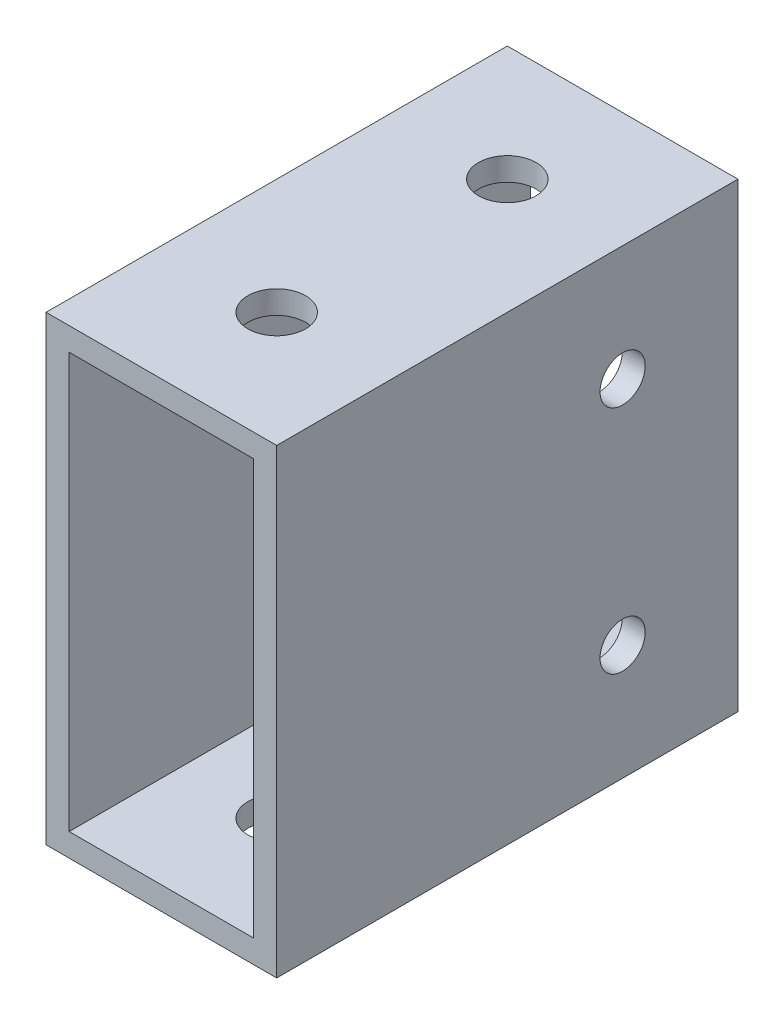
ISO-10303-21;
HEADER;
FILE_DESCRIPTION(('STEP AP214'),'2;1');
FILE_NAME('part.step','',(''),(''),'','','');
FILE_SCHEMA(('AUTOMOTIVE_DESIGN { 1 0 10303 214 1 1 1 1 }'));
ENDSEC;
DATA;
#1=APPLICATION_CONTEXT('core data for automotive mechanical design processes');
#2=APPLICATION_PROTOCOL_DEFINITION('international standard','automotive_design',2000,#1);
#3=PRODUCT_CONTEXT('',#1,'mechanical');
#4=PRODUCT('Part','Part','',(#3));
#5=PRODUCT_RELATED_PRODUCT_CATEGORY('part','',(#4));
#6=PRODUCT_DEFINITION_FORMATION('','',#4);
#7=PRODUCT_DEFINITION_CONTEXT('part definition',#1,'design');
#8=PRODUCT_DEFINITION('design','',#6,#7);
#9=PRODUCT_DEFINITION_SHAPE('','',#8);
#10=(LENGTH_UNIT() NAMED_UNIT(*) SI_UNIT(.MILLI.,.METRE.));
#11=(NAMED_UNIT(*) PLANE_ANGLE_UNIT() SI_UNIT($,.RADIAN.));
#12=(NAMED_UNIT(*) SI_UNIT($,.STERADIAN.) SOLID_ANGLE_UNIT());
#13=UNCERTAINTY_MEASURE_WITH_UNIT(LENGTH_MEASURE(1.E-05),#10,'distance_accuracy_value','');
#14=(GEOMETRIC_REPRESENTATION_CONTEXT(3) GLOBAL_UNCERTAINTY_ASSIGNED_CONTEXT((#13)) GLOBAL_UNIT_ASSIGNED_CONTEXT((#10,
#11,#12)) REPRESENTATION_CONTEXT('',''));
#15=CARTESIAN_POINT('',(0.,0.,0.));
#16=DIRECTION('',(0.,0.,1.));
#17=DIRECTION('',(1.,0.,0.));
#18=AXIS2_PLACEMENT_3D('',#15,#16,#17);
#19=CARTESIAN_POINT('',(0.,0.,25.4));
#20=DIRECTION('',(0.,0.,1.));
#21=DIRECTION('',(1.,0.,0.));
#22=AXIS2_PLACEMENT_3D('',#19,#20,#21);
#23=PLANE('',#22);
#24=DIRECTION('',(0.,1.,0.));
#25=VECTOR('',#24,1.);
#26=CARTESIAN_POINT('',(12.7,-25.4,25.4));
#27=LINE('',#26,#25);
#28=CARTESIAN_POINT('',(12.7,-25.4,25.4));
#29=VERTEX_POINT('',#28);
#30=CARTESIAN_POINT('',(12.7,25.4,25.4));
#31=VERTEX_POINT('',#30);
#32=EDGE_CURVE('E165',#29,#31,#27,.T.);
#33=ORIENTED_EDGE('',*,*,#32,.T.);
#34=DIRECTION('',(-1.,0.,0.));
#35=VECTOR('',#34,1.);
#36=CARTESIAN_POINT('',(-12.7,25.4,25.4));
#37=LINE('',#36,#35);
#38=CARTESIAN_POINT('',(-12.7,25.4,25.4));
#39=VERTEX_POINT('',#38);
#40=EDGE_CURVE('E168',#31,#39,#37,.T.);
#41=ORIENTED_EDGE('',*,*,#40,.T.);
#42=DIRECTION('',(0.,-1.,0.));
#43=VECTOR('',#42,1.);
#44=CARTESIAN_POINT('',(-12.7,-25.4,25.4));
#45=LINE('',#44,#43);
#46=CARTESIAN_POINT('',(-12.7,-25.4,25.4));
#47=VERTEX_POINT('',#46);
#48=EDGE_CURVE('E171',#39,#47,#45,.T.);
#49=ORIENTED_EDGE('',*,*,#48,.T.);
#50=DIRECTION('',(1.,0.,0.));
#51=VECTOR('',#50,1.);
#52=CARTESIAN_POINT('',(-12.7,-25.4,25.4));
#53=LINE('',#52,#51);
#54=EDGE_CURVE('E173',#47,#29,#53,.T.);
#55=ORIENTED_EDGE('',*,*,#54,.T.);
#56=EDGE_LOOP('',(#33,#41,#49,#55));
#57=FACE_BOUND('',#56,.T.);
#58=DIRECTION('',(-1.,0.,0.));
#59=VECTOR('',#58,1.);
#60=CARTESIAN_POINT('',(0.,22.86,25.4));
#61=LINE('',#60,#59);
#62=CARTESIAN_POINT('',(10.16,22.86,25.4));
#63=VERTEX_POINT('',#62);
#64=CARTESIAN_POINT('',(-10.16,22.86,25.4));
#65=VERTEX_POINT('',#64);
#66=EDGE_CURVE('E135',#63,#65,#61,.T.);
#67=ORIENTED_EDGE('',*,*,#66,.F.);
#68=DIRECTION('',(0.,1.,0.));
#69=VECTOR('',#68,1.);
#70=CARTESIAN_POINT('',(10.16,0.,25.4));
#71=LINE('',#70,#69);
#72=CARTESIAN_POINT('',(10.16,-22.86,25.4));
#73=VERTEX_POINT('',#72);
#74=EDGE_CURVE('E127',#73,#63,#71,.T.);
#75=ORIENTED_EDGE('',*,*,#74,.F.);
#76=DIRECTION('',(1.,0.,0.));
#77=VECTOR('',#76,1.);
#78=CARTESIAN_POINT('',(0.,-22.86,25.4));
#79=LINE('',#78,#77);
#80=CARTESIAN_POINT('',(-10.16,-22.86,25.4));
#81=VERTEX_POINT('',#80);
#82=EDGE_CURVE('E149',#81,#73,#79,.T.);
#83=ORIENTED_EDGE('',*,*,#82,.F.);
#84=DIRECTION('',(0.,-1.,0.));
#85=VECTOR('',#84,1.);
#86=CARTESIAN_POINT('',(-10.16,0.,25.4));
#87=LINE('',#86,#85);
#88=EDGE_CURVE('E147',#65,#81,#87,.T.);
#89=ORIENTED_EDGE('',*,*,#88,.F.);
#90=EDGE_LOOP('',(#67,#75,#83,#89));
#91=FACE_BOUND('',#90,.T.);
#92=ADVANCED_FACE('F60',(#57,#91),#23,.T.);
#93=CARTESIAN_POINT('',(0.,0.,-25.4));
#94=DIRECTION('',(0.,0.,1.));
#95=DIRECTION('',(1.,0.,0.));
#96=AXIS2_PLACEMENT_3D('',#93,#94,#95);
#97=PLANE('',#96);
#98=DIRECTION('',(0.,1.,0.));
#99=VECTOR('',#98,1.);
#100=CARTESIAN_POINT('',(12.7,-25.4,-25.4));
#101=LINE('',#100,#99);
#102=CARTESIAN_POINT('',(12.7,-25.4,-25.4));
#103=VERTEX_POINT('',#102);
#104=CARTESIAN_POINT('',(12.7,25.4,-25.4));
#105=VERTEX_POINT('',#104);
#106=EDGE_CURVE('E143',#103,#105,#101,.T.);
#107=ORIENTED_EDGE('',*,*,#106,.F.);
#108=DIRECTION('',(1.,0.,0.));
#109=VECTOR('',#108,1.);
#110=CARTESIAN_POINT('',(-12.7,-25.4,-25.4));
#111=LINE('',#110,#109);
#112=CARTESIAN_POINT('',(-12.7,-25.4,-25.4));
#113=VERTEX_POINT('',#112);
#114=EDGE_CURVE('E169',#113,#103,#111,.T.);
#115=ORIENTED_EDGE('',*,*,#114,.F.);
#116=DIRECTION('',(0.,-1.,0.));
#117=VECTOR('',#116,1.);
#118=CARTESIAN_POINT('',(-12.7,-25.4,-25.4));
#119=LINE('',#118,#117);
#120=CARTESIAN_POINT('',(-12.7,25.4,-25.4));
#121=VERTEX_POINT('',#120);
#122=EDGE_CURVE('E180',#121,#113,#119,.T.);
#123=ORIENTED_EDGE('',*,*,#122,.F.);
#124=DIRECTION('',(-1.,0.,0.));
#125=VECTOR('',#124,1.);
#126=CARTESIAN_POINT('',(-12.7,25.4,-25.4));
#127=LINE('',#126,#125);
#128=EDGE_CURVE('E178',#105,#121,#127,.T.);
#129=ORIENTED_EDGE('',*,*,#128,.F.);
#130=EDGE_LOOP('',(#107,#115,#123,#129));
#131=FACE_BOUND('',#130,.T.);
#132=DIRECTION('',(0.,1.,0.));
#133=VECTOR('',#132,1.);
#134=CARTESIAN_POINT('',(10.16,0.,-25.4));
#135=LINE('',#134,#133);
#136=CARTESIAN_POINT('',(10.16,-22.86,-25.4));
#137=VERTEX_POINT('',#136);
#138=CARTESIAN_POINT('',(10.16,22.86,-25.4));
#139=VERTEX_POINT('',#138);
#140=EDGE_CURVE('E85',#137,#139,#135,.T.);
#141=ORIENTED_EDGE('',*,*,#140,.T.);
#142=DIRECTION('',(-1.,0.,0.));
#143=VECTOR('',#142,1.);
#144=CARTESIAN_POINT('',(0.,22.86,-25.4));
#145=LINE('',#144,#143);
#146=CARTESIAN_POINT('',(-10.16,22.86,-25.4));
#147=VERTEX_POINT('',#146);
#148=EDGE_CURVE('E142',#139,#147,#145,.T.);
#149=ORIENTED_EDGE('',*,*,#148,.T.);
#150=DIRECTION('',(0.,-1.,0.));
#151=VECTOR('',#150,1.);
#152=CARTESIAN_POINT('',(-10.16,0.,-25.4));
#153=LINE('',#152,#151);
#154=CARTESIAN_POINT('',(-10.16,-22.86,-25.4));
#155=VERTEX_POINT('',#154);
#156=EDGE_CURVE('E157',#147,#155,#153,.T.);
#157=ORIENTED_EDGE('',*,*,#156,.T.);
#158=DIRECTION('',(1.,0.,0.));
#159=VECTOR('',#158,1.);
#160=CARTESIAN_POINT('',(0.,-22.86,-25.4));
#161=LINE('',#160,#159);
#162=EDGE_CURVE('E136',#155,#137,#161,.T.);
#163=ORIENTED_EDGE('',*,*,#162,.T.);
#164=EDGE_LOOP('',(#141,#149,#157,#163));
#165=FACE_BOUND('',#164,.T.);
#166=ADVANCED_FACE('F268',(#131,#165),#97,.F.);
#167=CARTESIAN_POINT('',(12.7,-25.4,25.4));
#168=DIRECTION('',(-1.,0.,0.));
#169=DIRECTION('',(0.,0.,1.));
#170=AXIS2_PLACEMENT_3D('',#167,#168,#169);
#171=PLANE('',#170);
#172=CARTESIAN_POINT('',(12.7,12.7,-12.7));
#173=DIRECTION('',(1.,0.,0.));
#174=DIRECTION('',(0.,0.,-1.));
#175=AXIS2_PLACEMENT_3D('',#172,#173,#174);
#176=CIRCLE('',#175,2.4892);
#177=CARTESIAN_POINT('',(12.7,12.7,-15.1892));
#178=VERTEX_POINT('',#177);
#179=EDGE_CURVE('E206',#178,#178,#176,.T.);
#180=ORIENTED_EDGE('',*,*,#179,.F.);
#181=EDGE_LOOP('',(#180));
#182=FACE_BOUND('',#181,.T.);
#183=CARTESIAN_POINT('',(12.7,-12.7,-12.7));
#184=DIRECTION('',(1.,0.,0.));
#185=DIRECTION('',(0.,0.,-1.));
#186=AXIS2_PLACEMENT_3D('',#183,#184,#185);
#187=CIRCLE('',#186,2.4892);
#188=CARTESIAN_POINT('',(12.7,-12.7,-15.1892));
#189=VERTEX_POINT('',#188);
#190=EDGE_CURVE('E216',#189,#189,#187,.T.);
#191=ORIENTED_EDGE('',*,*,#190,.F.);
#192=EDGE_LOOP('',(#191));
#193=FACE_BOUND('',#192,.T.);
#194=ORIENTED_EDGE('',*,*,#106,.T.);
#195=DIRECTION('',(0.,0.,-1.));
#196=VECTOR('',#195,1.);
#197=CARTESIAN_POINT('',(12.7,25.4,25.4));
#198=LINE('',#197,#196);
#199=EDGE_CURVE('E12',#31,#105,#198,.T.);
#200=ORIENTED_EDGE('',*,*,#199,.F.);
#201=ORIENTED_EDGE('',*,*,#32,.F.);
#202=DIRECTION('',(0.,0.,-1.));
#203=VECTOR('',#202,1.);
#204=CARTESIAN_POINT('',(12.7,-25.4,25.4));
#205=LINE('',#204,#203);
#206=EDGE_CURVE('E175',#29,#103,#205,.T.);
#207=ORIENTED_EDGE('',*,*,#206,.T.);
#208=EDGE_LOOP('',(#194,#200,#201,#207));
#209=FACE_BOUND('',#208,.T.);
#210=ADVANCED_FACE('F62',(#182,#193,#209),#171,.F.);
#211=CARTESIAN_POINT('',(-12.7,25.4,25.4));
#212=DIRECTION('',(0.,-1.,0.));
#213=DIRECTION('',(0.,0.,-1.));
#214=AXIS2_PLACEMENT_3D('',#211,#212,#213);
#215=PLANE('',#214);
#216=CARTESIAN_POINT('',(0.,25.4,-12.7));
#217=DIRECTION('',(0.,1.,0.));
#218=DIRECTION('',(0.,0.,1.));
#219=AXIS2_PLACEMENT_3D('',#216,#217,#218);
#220=CIRCLE('',#219,3.175);
#221=CARTESIAN_POINT('',(0.,25.4,-9.525));
#222=VERTEX_POINT('',#221);
#223=EDGE_CURVE('E225',#222,#222,#220,.T.);
#224=ORIENTED_EDGE('',*,*,#223,.F.);
#225=EDGE_LOOP('',(#224));
#226=FACE_BOUND('',#225,.T.);
#227=CARTESIAN_POINT('',(0.,25.4,12.7));
#228=DIRECTION('',(0.,1.,0.));
#229=DIRECTION('',(0.,0.,1.));
#230=AXIS2_PLACEMENT_3D('',#227,#228,#229);
#231=CIRCLE('',#230,3.175);
#232=CARTESIAN_POINT('',(0.,25.4,15.875));
#233=VERTEX_POINT('',#232);
#234=EDGE_CURVE('E222',#233,#233,#231,.T.);
#235=ORIENTED_EDGE('',*,*,#234,.F.);
#236=EDGE_LOOP('',(#235));
#237=FACE_BOUND('',#236,.T.);
#238=ORIENTED_EDGE('',*,*,#128,.T.);
#239=DIRECTION('',(0.,0.,-1.));
#240=VECTOR('',#239,1.);
#241=CARTESIAN_POINT('',(-12.7,25.4,25.4));
#242=LINE('',#241,#240);
#243=EDGE_CURVE('E69',#39,#121,#242,.T.);
#244=ORIENTED_EDGE('',*,*,#243,.F.);
#245=ORIENTED_EDGE('',*,*,#40,.F.);
#246=ORIENTED_EDGE('',*,*,#199,.T.);
#247=EDGE_LOOP('',(#238,#244,#245,#246));
#248=FACE_BOUND('',#247,.T.);
#249=ADVANCED_FACE('F254',(#226,#237,#248),#215,.F.);
#250=CARTESIAN_POINT('',(-12.7,-25.4,25.4));
#251=DIRECTION('',(1.,0.,0.));
#252=DIRECTION('',(0.,0.,-1.));
#253=AXIS2_PLACEMENT_3D('',#250,#251,#252);
#254=PLANE('',#253);
#255=CARTESIAN_POINT('',(-12.7,12.7,-12.7));
#256=DIRECTION('',(1.,0.,0.));
#257=DIRECTION('',(0.,0.,-1.));
#258=AXIS2_PLACEMENT_3D('',#255,#256,#257);
#259=CIRCLE('',#258,2.4892);
#260=CARTESIAN_POINT('',(-12.7,12.7,-15.1892));
#261=VERTEX_POINT('',#260);
#262=EDGE_CURVE('E200',#261,#261,#259,.T.);
#263=ORIENTED_EDGE('',*,*,#262,.T.);
#264=EDGE_LOOP('',(#263));
#265=FACE_BOUND('',#264,.T.);
#266=CARTESIAN_POINT('',(-12.7,-12.7,-12.7));
#267=DIRECTION('',(1.,0.,0.));
#268=DIRECTION('',(0.,0.,-1.));
#269=AXIS2_PLACEMENT_3D('',#266,#267,#268);
#270=CIRCLE('',#269,2.4892);
#271=CARTESIAN_POINT('',(-12.7,-12.7,-15.1892));
#272=VERTEX_POINT('',#271);
#273=EDGE_CURVE('E211',#272,#272,#270,.T.);
#274=ORIENTED_EDGE('',*,*,#273,.T.);
#275=EDGE_LOOP('',(#274));
#276=FACE_BOUND('',#275,.T.);
#277=ORIENTED_EDGE('',*,*,#122,.T.);
#278=DIRECTION('',(0.,0.,-1.));
#279=VECTOR('',#278,1.);
#280=CARTESIAN_POINT('',(-12.7,-25.4,25.4));
#281=LINE('',#280,#279);
#282=EDGE_CURVE('E185',#47,#113,#281,.T.);
#283=ORIENTED_EDGE('',*,*,#282,.F.);
#284=ORIENTED_EDGE('',*,*,#48,.F.);
#285=ORIENTED_EDGE('',*,*,#243,.T.);
#286=EDGE_LOOP('',(#277,#283,#284,#285));
#287=FACE_BOUND('',#286,.T.);
#288=ADVANCED_FACE('F257',(#265,#276,#287),#254,.F.);
#289=CARTESIAN_POINT('',(-12.7,-25.4,25.4));
#290=DIRECTION('',(0.,1.,0.));
#291=DIRECTION('',(0.,0.,1.));
#292=AXIS2_PLACEMENT_3D('',#289,#290,#291);
#293=PLANE('',#292);
#294=CARTESIAN_POINT('',(0.,-25.4,-12.7));
#295=DIRECTION('',(0.,1.,0.));
#296=DIRECTION('',(0.,0.,1.));
#297=AXIS2_PLACEMENT_3D('',#294,#295,#296);
#298=CIRCLE('',#297,3.175);
#299=CARTESIAN_POINT('',(0.,-25.4,-9.525));
#300=VERTEX_POINT('',#299);
#301=EDGE_CURVE('E194',#300,#300,#298,.T.);
#302=ORIENTED_EDGE('',*,*,#301,.T.);
#303=EDGE_LOOP('',(#302));
#304=FACE_BOUND('',#303,.T.);
#305=CARTESIAN_POINT('',(0.,-25.4,12.7));
#306=DIRECTION('',(0.,1.,0.));
#307=DIRECTION('',(0.,0.,1.));
#308=AXIS2_PLACEMENT_3D('',#305,#306,#307);
#309=CIRCLE('',#308,3.175);
#310=CARTESIAN_POINT('',(0.,-25.4,15.875));
#311=VERTEX_POINT('',#310);
#312=EDGE_CURVE('E228',#311,#311,#309,.T.);
#313=ORIENTED_EDGE('',*,*,#312,.T.);
#314=EDGE_LOOP('',(#313));
#315=FACE_BOUND('',#314,.T.);
#316=ORIENTED_EDGE('',*,*,#114,.T.);
#317=ORIENTED_EDGE('',*,*,#206,.F.);
#318=ORIENTED_EDGE('',*,*,#54,.F.);
#319=ORIENTED_EDGE('',*,*,#282,.T.);
#320=EDGE_LOOP('',(#316,#317,#318,#319));
#321=FACE_BOUND('',#320,.T.);
#322=ADVANCED_FACE('F272',(#304,#315,#321),#293,.F.);
#323=CARTESIAN_POINT('',(10.16,0.,25.4));
#324=DIRECTION('',(-1.,0.,0.));
#325=DIRECTION('',(0.,0.,1.));
#326=AXIS2_PLACEMENT_3D('',#323,#324,#325);
#327=PLANE('',#326);
#328=CARTESIAN_POINT('',(10.16,12.7,-12.7));
#329=DIRECTION('',(-1.,0.,0.));
#330=DIRECTION('',(0.,0.,1.));
#331=AXIS2_PLACEMENT_3D('',#328,#329,#330);
#332=CIRCLE('',#331,2.4892);
#333=CARTESIAN_POINT('',(10.16,12.7,-10.2108));
#334=VERTEX_POINT('',#333);
#335=EDGE_CURVE('E219',#334,#334,#332,.T.);
#336=ORIENTED_EDGE('',*,*,#335,.F.);
#337=EDGE_LOOP('',(#336));
#338=FACE_BOUND('',#337,.T.);
#339=CARTESIAN_POINT('',(10.16,-12.7,-12.7));
#340=DIRECTION('',(-1.,0.,0.));
#341=DIRECTION('',(0.,0.,1.));
#342=AXIS2_PLACEMENT_3D('',#339,#340,#341);
#343=CIRCLE('',#342,2.4892);
#344=CARTESIAN_POINT('',(10.16,-12.7,-10.2108));
#345=VERTEX_POINT('',#344);
#346=EDGE_CURVE('E199',#345,#345,#343,.T.);
#347=ORIENTED_EDGE('',*,*,#346,.F.);
#348=EDGE_LOOP('',(#347));
#349=FACE_BOUND('',#348,.T.);
#350=ORIENTED_EDGE('',*,*,#140,.F.);
#351=DIRECTION('',(0.,0.,-1.));
#352=VECTOR('',#351,1.);
#353=CARTESIAN_POINT('',(10.16,-22.86,25.4));
#354=LINE('',#353,#352);
#355=EDGE_CURVE('E131',#73,#137,#354,.T.);
#356=ORIENTED_EDGE('',*,*,#355,.F.);
#357=ORIENTED_EDGE('',*,*,#74,.T.);
#358=DIRECTION('',(0.,0.,-1.));
#359=VECTOR('',#358,1.);
#360=CARTESIAN_POINT('',(10.16,22.86,25.4));
#361=LINE('',#360,#359);
#362=EDGE_CURVE('E130',#63,#139,#361,.T.);
#363=ORIENTED_EDGE('',*,*,#362,.T.);
#364=EDGE_LOOP('',(#350,#356,#357,#363));
#365=FACE_BOUND('',#364,.T.);
#366=ADVANCED_FACE('F129',(#338,#349,#365),#327,.T.);
#367=CARTESIAN_POINT('',(0.,22.86,25.4));
#368=DIRECTION('',(0.,-1.,0.));
#369=DIRECTION('',(0.,0.,-1.));
#370=AXIS2_PLACEMENT_3D('',#367,#368,#369);
#371=PLANE('',#370);
#372=CARTESIAN_POINT('',(0.,22.86,-12.7));
#373=DIRECTION('',(0.,-1.,0.));
#374=DIRECTION('',(0.,0.,-1.));
#375=AXIS2_PLACEMENT_3D('',#372,#373,#374);
#376=CIRCLE('',#375,3.175);
#377=CARTESIAN_POINT('',(0.,22.86,-15.875));
#378=VERTEX_POINT('',#377);
#379=EDGE_CURVE('E155',#378,#378,#376,.T.);
#380=ORIENTED_EDGE('',*,*,#379,.F.);
#381=EDGE_LOOP('',(#380));
#382=FACE_BOUND('',#381,.T.);
#383=CARTESIAN_POINT('',(0.,22.86,12.7));
#384=DIRECTION('',(0.,-1.,0.));
#385=DIRECTION('',(0.,0.,-1.));
#386=AXIS2_PLACEMENT_3D('',#383,#384,#385);
#387=CIRCLE('',#386,3.175);
#388=CARTESIAN_POINT('',(0.,22.86,9.525));
#389=VERTEX_POINT('',#388);
#390=EDGE_CURVE('E193',#389,#389,#387,.T.);
#391=ORIENTED_EDGE('',*,*,#390,.F.);
#392=EDGE_LOOP('',(#391));
#393=FACE_BOUND('',#392,.T.);
#394=ORIENTED_EDGE('',*,*,#148,.F.);
#395=ORIENTED_EDGE('',*,*,#362,.F.);
#396=ORIENTED_EDGE('',*,*,#66,.T.);
#397=DIRECTION('',(0.,0.,-1.));
#398=VECTOR('',#397,1.);
#399=CARTESIAN_POINT('',(-10.16,22.86,25.4));
#400=LINE('',#399,#398);
#401=EDGE_CURVE('E144',#65,#147,#400,.T.);
#402=ORIENTED_EDGE('',*,*,#401,.T.);
#403=EDGE_LOOP('',(#394,#395,#396,#402));
#404=FACE_BOUND('',#403,.T.);
#405=ADVANCED_FACE('F139',(#382,#393,#404),#371,.T.);
#406=CARTESIAN_POINT('',(-10.16,0.,25.4));
#407=DIRECTION('',(1.,0.,0.));
#408=DIRECTION('',(0.,0.,-1.));
#409=AXIS2_PLACEMENT_3D('',#406,#407,#408);
#410=PLANE('',#409);
#411=CARTESIAN_POINT('',(-10.16,12.7,-12.7));
#412=DIRECTION('',(1.,0.,0.));
#413=DIRECTION('',(0.,0.,-1.));
#414=AXIS2_PLACEMENT_3D('',#411,#412,#413);
#415=CIRCLE('',#414,2.4892);
#416=CARTESIAN_POINT('',(-10.16,12.7,-15.1892));
#417=VERTEX_POINT('',#416);
#418=EDGE_CURVE('E64',#417,#417,#415,.T.);
#419=ORIENTED_EDGE('',*,*,#418,.F.);
#420=EDGE_LOOP('',(#419));
#421=FACE_BOUND('',#420,.T.);
#422=CARTESIAN_POINT('',(-10.16,-12.7,-12.7));
#423=DIRECTION('',(1.,0.,0.));
#424=DIRECTION('',(0.,0.,-1.));
#425=AXIS2_PLACEMENT_3D('',#422,#423,#424);
#426=CIRCLE('',#425,2.4892);
#427=CARTESIAN_POINT('',(-10.16,-12.7,-15.1892));
#428=VERTEX_POINT('',#427);
#429=EDGE_CURVE('E197',#428,#428,#426,.T.);
#430=ORIENTED_EDGE('',*,*,#429,.F.);
#431=EDGE_LOOP('',(#430));
#432=FACE_BOUND('',#431,.T.);
#433=ORIENTED_EDGE('',*,*,#156,.F.);
#434=ORIENTED_EDGE('',*,*,#401,.F.);
#435=ORIENTED_EDGE('',*,*,#88,.T.);
#436=DIRECTION('',(0.,0.,-1.));
#437=VECTOR('',#436,1.);
#438=CARTESIAN_POINT('',(-10.16,-22.86,25.4));
#439=LINE('',#438,#437);
#440=EDGE_CURVE('E77',#81,#155,#439,.T.);
#441=ORIENTED_EDGE('',*,*,#440,.T.);
#442=EDGE_LOOP('',(#433,#434,#435,#441));
#443=FACE_BOUND('',#442,.T.);
#444=ADVANCED_FACE('F242',(#421,#432,#443),#410,.T.);
#445=CARTESIAN_POINT('',(0.,-22.86,25.4));
#446=DIRECTION('',(0.,1.,0.));
#447=DIRECTION('',(0.,0.,1.));
#448=AXIS2_PLACEMENT_3D('',#445,#446,#447);
#449=PLANE('',#448);
#450=CARTESIAN_POINT('',(0.,-22.86,-12.7));
#451=DIRECTION('',(0.,1.,0.));
#452=DIRECTION('',(0.,0.,1.));
#453=AXIS2_PLACEMENT_3D('',#450,#451,#452);
#454=CIRCLE('',#453,3.175);
#455=CARTESIAN_POINT('',(0.,-22.86,-9.525));
#456=VERTEX_POINT('',#455);
#457=EDGE_CURVE('E195',#456,#456,#454,.T.);
#458=ORIENTED_EDGE('',*,*,#457,.F.);
#459=EDGE_LOOP('',(#458));
#460=FACE_BOUND('',#459,.T.);
#461=CARTESIAN_POINT('',(0.,-22.86,12.7));
#462=DIRECTION('',(0.,1.,0.));
#463=DIRECTION('',(0.,0.,1.));
#464=AXIS2_PLACEMENT_3D('',#461,#462,#463);
#465=CIRCLE('',#464,3.175);
#466=CARTESIAN_POINT('',(0.,-22.86,15.875));
#467=VERTEX_POINT('',#466);
#468=EDGE_CURVE('E190',#467,#467,#465,.T.);
#469=ORIENTED_EDGE('',*,*,#468,.F.);
#470=EDGE_LOOP('',(#469));
#471=FACE_BOUND('',#470,.T.);
#472=ORIENTED_EDGE('',*,*,#162,.F.);
#473=ORIENTED_EDGE('',*,*,#440,.F.);
#474=ORIENTED_EDGE('',*,*,#82,.T.);
#475=ORIENTED_EDGE('',*,*,#355,.T.);
#476=EDGE_LOOP('',(#472,#473,#474,#475));
#477=FACE_BOUND('',#476,.T.);
#478=ADVANCED_FACE('F354',(#460,#471,#477),#449,.T.);
#479=CARTESIAN_POINT('',(0.,-25.4,12.7));
#480=DIRECTION('',(0.,1.,0.));
#481=DIRECTION('',(0.,0.,1.));
#482=AXIS2_PLACEMENT_3D('',#479,#480,#481);
#483=CYLINDRICAL_SURFACE('',#482,3.175);
#484=ORIENTED_EDGE('',*,*,#468,.T.);
#485=EDGE_LOOP('',(#484));
#486=FACE_BOUND('',#485,.T.);
#487=ORIENTED_EDGE('',*,*,#312,.F.);
#488=EDGE_LOOP('',(#487));
#489=FACE_BOUND('',#488,.T.);
#490=ADVANCED_FACE('F251',(#486,#489),#483,.F.);
#491=CARTESIAN_POINT('',(0.,-25.4,-12.7));
#492=DIRECTION('',(0.,1.,0.));
#493=DIRECTION('',(0.,0.,1.));
#494=AXIS2_PLACEMENT_3D('',#491,#492,#493);
#495=CYLINDRICAL_SURFACE('',#494,3.175);
#496=ORIENTED_EDGE('',*,*,#457,.T.);
#497=EDGE_LOOP('',(#496));
#498=FACE_BOUND('',#497,.T.);
#499=ORIENTED_EDGE('',*,*,#301,.F.);
#500=EDGE_LOOP('',(#499));
#501=FACE_BOUND('',#500,.T.);
#502=ADVANCED_FACE('F249',(#498,#501),#495,.F.);
#503=ORIENTED_EDGE('',*,*,#390,.T.);
#504=EDGE_LOOP('',(#503));
#505=FACE_BOUND('',#504,.T.);
#506=ORIENTED_EDGE('',*,*,#234,.T.);
#507=EDGE_LOOP('',(#506));
#508=FACE_BOUND('',#507,.T.);
#509=ADVANCED_FACE('F246',(#505,#508),#483,.F.);
#510=ORIENTED_EDGE('',*,*,#379,.T.);
#511=EDGE_LOOP('',(#510));
#512=FACE_BOUND('',#511,.T.);
#513=ORIENTED_EDGE('',*,*,#223,.T.);
#514=EDGE_LOOP('',(#513));
#515=FACE_BOUND('',#514,.T.);
#516=ADVANCED_FACE('F237',(#512,#515),#495,.F.);
#517=CARTESIAN_POINT('',(-12.7,-12.7,-12.7));
#518=DIRECTION('',(1.,0.,0.));
#519=DIRECTION('',(0.,0.,-1.));
#520=AXIS2_PLACEMENT_3D('',#517,#518,#519);
#521=CYLINDRICAL_SURFACE('',#520,2.4892);
#522=ORIENTED_EDGE('',*,*,#429,.T.);
#523=EDGE_LOOP('',(#522));
#524=FACE_BOUND('',#523,.T.);
#525=ORIENTED_EDGE('',*,*,#273,.F.);
#526=EDGE_LOOP('',(#525));
#527=FACE_BOUND('',#526,.T.);
#528=ADVANCED_FACE('F294',(#524,#527),#521,.F.);
#529=CARTESIAN_POINT('',(-12.7,12.7,-12.7));
#530=DIRECTION('',(1.,0.,0.));
#531=DIRECTION('',(0.,0.,-1.));
#532=AXIS2_PLACEMENT_3D('',#529,#530,#531);
#533=CYLINDRICAL_SURFACE('',#532,2.4892);
#534=ORIENTED_EDGE('',*,*,#418,.T.);
#535=EDGE_LOOP('',(#534));
#536=FACE_BOUND('',#535,.T.);
#537=ORIENTED_EDGE('',*,*,#262,.F.);
#538=EDGE_LOOP('',(#537));
#539=FACE_BOUND('',#538,.T.);
#540=ADVANCED_FACE('F296',(#536,#539),#533,.F.);
#541=ORIENTED_EDGE('',*,*,#346,.T.);
#542=EDGE_LOOP('',(#541));
#543=FACE_BOUND('',#542,.T.);
#544=ORIENTED_EDGE('',*,*,#190,.T.);
#545=EDGE_LOOP('',(#544));
#546=FACE_BOUND('',#545,.T.);
#547=ADVANCED_FACE('F298',(#543,#546),#521,.F.);
#548=ORIENTED_EDGE('',*,*,#335,.T.);
#549=EDGE_LOOP('',(#548));
#550=FACE_BOUND('',#549,.T.);
#551=ORIENTED_EDGE('',*,*,#179,.T.);
#552=EDGE_LOOP('',(#551));
#553=FACE_BOUND('',#552,.T.);
#554=ADVANCED_FACE('F305',(#550,#553),#533,.F.);
#555=CLOSED_SHELL('',(#92,#166,#210,#249,#288,#322,#366,#405,#444,#478,#490,#502,#509,#516,#528,
#540,#547,#554));
#556=MANIFOLD_SOLID_BREP('B2',#555);
#557=ADVANCED_BREP_SHAPE_REPRESENTATION('',(#18,#556),#14);
#558=SHAPE_DEFINITION_REPRESENTATION(#9,#557);
ENDSEC;
END-ISO-10303-21;
